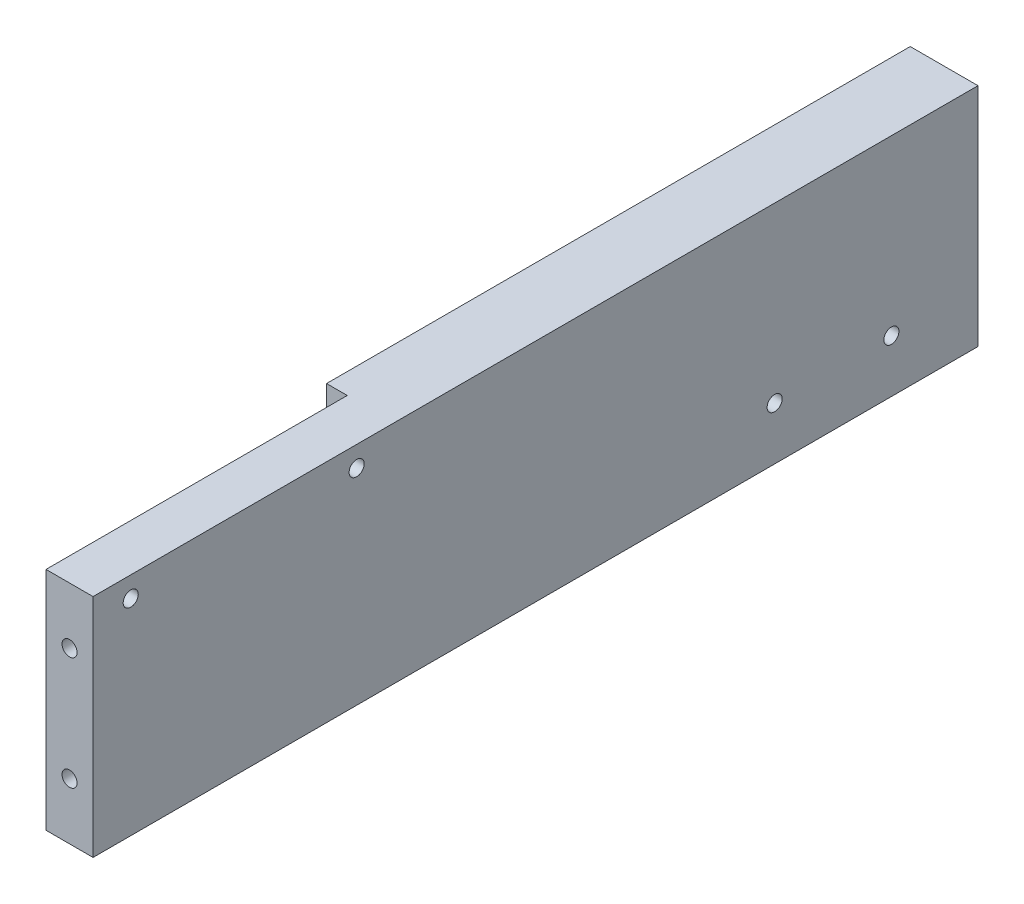
ISO-10303-21;
HEADER;
FILE_DESCRIPTION(('STEP AP214'),'2;1');
FILE_NAME('part.step','',(''),(''),'','','');
FILE_SCHEMA(('AUTOMOTIVE_DESIGN { 1 0 10303 214 1 1 1 1 }'));
ENDSEC;
DATA;
#1=APPLICATION_CONTEXT('core data for automotive mechanical design processes');
#2=APPLICATION_PROTOCOL_DEFINITION('international standard','automotive_design',2000,#1);
#3=PRODUCT_CONTEXT('',#1,'mechanical');
#4=PRODUCT('Part','Part','',(#3));
#5=PRODUCT_RELATED_PRODUCT_CATEGORY('part','',(#4));
#6=PRODUCT_DEFINITION_FORMATION('','',#4);
#7=PRODUCT_DEFINITION_CONTEXT('part definition',#1,'design');
#8=PRODUCT_DEFINITION('design','',#6,#7);
#9=PRODUCT_DEFINITION_SHAPE('','',#8);
#10=(LENGTH_UNIT() NAMED_UNIT(*) SI_UNIT(.MILLI.,.METRE.));
#11=(NAMED_UNIT(*) PLANE_ANGLE_UNIT() SI_UNIT($,.RADIAN.));
#12=(NAMED_UNIT(*) SI_UNIT($,.STERADIAN.) SOLID_ANGLE_UNIT());
#13=UNCERTAINTY_MEASURE_WITH_UNIT(LENGTH_MEASURE(1.E-05),#10,'distance_accuracy_value','');
#14=(GEOMETRIC_REPRESENTATION_CONTEXT(3) GLOBAL_UNCERTAINTY_ASSIGNED_CONTEXT((#13)) GLOBAL_UNIT_ASSIGNED_CONTEXT((#10,
#11,#12)) REPRESENTATION_CONTEXT('',''));
#15=CARTESIAN_POINT('',(0.,0.,0.));
#16=DIRECTION('',(0.,0.,1.));
#17=DIRECTION('',(1.,0.,0.));
#18=AXIS2_PLACEMENT_3D('',#15,#16,#17);
#19=CARTESIAN_POINT('',(-18.,8.00000000000001,0.));
#20=DIRECTION('',(0.,-1.,0.));
#21=DIRECTION('',(0.,0.,-1.));
#22=AXIS2_PLACEMENT_3D('',#19,#20,#21);
#23=PLANE('',#22);
#24=DIRECTION('',(0.,0.,-1.));
#25=VECTOR('',#24,1.);
#26=CARTESIAN_POINT('',(0.,8.00000000000001,0.));
#27=LINE('',#26,#25);
#28=CARTESIAN_POINT('',(0.,8.00000000000002,64.8267773742609));
#29=VERTEX_POINT('',#28);
#30=CARTESIAN_POINT('',(0.,7.99999999999998,-170.173222625739));
#31=VERTEX_POINT('',#30);
#32=EDGE_CURVE('E153',#29,#31,#27,.T.);
#33=ORIENTED_EDGE('',*,*,#32,.T.);
#34=DIRECTION('',(1.,0.,0.));
#35=VECTOR('',#34,1.);
#36=CARTESIAN_POINT('',(-18.,7.99999999999998,-170.173222625739));
#37=LINE('',#36,#35);
#38=CARTESIAN_POINT('',(-18.,7.99999999999998,-170.173222625739));
#39=VERTEX_POINT('',#38);
#40=EDGE_CURVE('E11',#39,#31,#37,.T.);
#41=ORIENTED_EDGE('',*,*,#40,.F.);
#42=DIRECTION('',(0.,0.,-1.));
#43=VECTOR('',#42,1.);
#44=CARTESIAN_POINT('',(-18.,8.00000000000001,0.));
#45=LINE('',#44,#43);
#46=CARTESIAN_POINT('',(-18.,8.00000000000001,-15.1732226257391));
#47=VERTEX_POINT('',#46);
#48=EDGE_CURVE('E140',#47,#39,#45,.T.);
#49=ORIENTED_EDGE('',*,*,#48,.F.);
#50=DIRECTION('',(1.,0.,0.));
#51=VECTOR('',#50,1.);
#52=CARTESIAN_POINT('',(-18.,8.00000000000001,-15.1732226257391));
#53=LINE('',#52,#51);
#54=CARTESIAN_POINT('',(-12.5,8.00000000000001,-15.1732226257391));
#55=VERTEX_POINT('',#54);
#56=EDGE_CURVE('E79',#47,#55,#53,.T.);
#57=ORIENTED_EDGE('',*,*,#56,.T.);
#58=DIRECTION('',(0.,0.,-1.));
#59=VECTOR('',#58,1.);
#60=CARTESIAN_POINT('',(-12.5,8.00000000000001,0.));
#61=LINE('',#60,#59);
#62=CARTESIAN_POINT('',(-12.5,8.00000000000002,64.8267773742609));
#63=VERTEX_POINT('',#62);
#64=EDGE_CURVE('E113',#63,#55,#61,.T.);
#65=ORIENTED_EDGE('',*,*,#64,.F.);
#66=DIRECTION('',(1.,0.,0.));
#67=VECTOR('',#66,1.);
#68=CARTESIAN_POINT('',(-12.5,8.00000000000002,64.8267773742609));
#69=LINE('',#68,#67);
#70=EDGE_CURVE('E98',#63,#29,#69,.T.);
#71=ORIENTED_EDGE('',*,*,#70,.T.);
#72=EDGE_LOOP('',(#33,#41,#49,#57,#65,#71));
#73=FACE_BOUND('',#72,.T.);
#74=ADVANCED_FACE('F35',(#73),#23,.F.);
#75=CARTESIAN_POINT('',(-18.,0.,-170.173222625739));
#76=DIRECTION('',(0.,0.,1.));
#77=DIRECTION('',(1.,0.,0.));
#78=AXIS2_PLACEMENT_3D('',#75,#76,#77);
#79=PLANE('',#78);
#80=DIRECTION('',(0.,-1.,0.));
#81=VECTOR('',#80,1.);
#82=CARTESIAN_POINT('',(0.,0.,-170.173222625739));
#83=LINE('',#82,#81);
#84=CARTESIAN_POINT('',(0.,-52.,-170.173222625739));
#85=VERTEX_POINT('',#84);
#86=EDGE_CURVE('E76',#31,#85,#83,.T.);
#87=ORIENTED_EDGE('',*,*,#86,.T.);
#88=DIRECTION('',(1.,0.,0.));
#89=VECTOR('',#88,1.);
#90=CARTESIAN_POINT('',(-18.,-52.,-170.173222625739));
#91=LINE('',#90,#89);
#92=CARTESIAN_POINT('',(-18.,-52.,-170.173222625739));
#93=VERTEX_POINT('',#92);
#94=EDGE_CURVE('E44',#93,#85,#91,.T.);
#95=ORIENTED_EDGE('',*,*,#94,.F.);
#96=DIRECTION('',(0.,-1.,0.));
#97=VECTOR('',#96,1.);
#98=CARTESIAN_POINT('',(-18.,0.,-170.173222625739));
#99=LINE('',#98,#97);
#100=EDGE_CURVE('E60',#39,#93,#99,.T.);
#101=ORIENTED_EDGE('',*,*,#100,.F.);
#102=ORIENTED_EDGE('',*,*,#40,.T.);
#103=EDGE_LOOP('',(#87,#95,#101,#102));
#104=FACE_BOUND('',#103,.T.);
#105=ADVANCED_FACE('F218',(#104),#79,.F.);
#106=CARTESIAN_POINT('',(-18.,-52.,0.));
#107=DIRECTION('',(0.,-1.,0.));
#108=DIRECTION('',(0.,0.,-1.));
#109=AXIS2_PLACEMENT_3D('',#106,#107,#108);
#110=PLANE('',#109);
#111=DIRECTION('',(0.,0.,-1.));
#112=VECTOR('',#111,1.);
#113=CARTESIAN_POINT('',(0.,-52.,0.));
#114=LINE('',#113,#112);
#115=CARTESIAN_POINT('',(0.,-52.,64.8267773742609));
#116=VERTEX_POINT('',#115);
#117=EDGE_CURVE('E155',#116,#85,#114,.T.);
#118=ORIENTED_EDGE('',*,*,#117,.F.);
#119=DIRECTION('',(1.,0.,0.));
#120=VECTOR('',#119,1.);
#121=CARTESIAN_POINT('',(-12.5,-52.,64.8267773742609));
#122=LINE('',#121,#120);
#123=CARTESIAN_POINT('',(-12.5,-52.,64.8267773742609));
#124=VERTEX_POINT('',#123);
#125=EDGE_CURVE('E109',#124,#116,#122,.T.);
#126=ORIENTED_EDGE('',*,*,#125,.F.);
#127=DIRECTION('',(0.,0.,-1.));
#128=VECTOR('',#127,1.);
#129=CARTESIAN_POINT('',(-12.5,-52.,0.));
#130=LINE('',#129,#128);
#131=CARTESIAN_POINT('',(-12.5,-52.,-15.1732226257391));
#132=VERTEX_POINT('',#131);
#133=EDGE_CURVE('E110',#124,#132,#130,.T.);
#134=ORIENTED_EDGE('',*,*,#133,.T.);
#135=DIRECTION('',(1.,0.,0.));
#136=VECTOR('',#135,1.);
#137=CARTESIAN_POINT('',(-18.,-52.,-15.1732226257391));
#138=LINE('',#137,#136);
#139=CARTESIAN_POINT('',(-18.,-52.,-15.1732226257391));
#140=VERTEX_POINT('',#139);
#141=EDGE_CURVE('E159',#140,#132,#138,.T.);
#142=ORIENTED_EDGE('',*,*,#141,.F.);
#143=DIRECTION('',(0.,0.,-1.));
#144=VECTOR('',#143,1.);
#145=CARTESIAN_POINT('',(-18.,-52.,0.));
#146=LINE('',#145,#144);
#147=EDGE_CURVE('E144',#140,#93,#146,.T.);
#148=ORIENTED_EDGE('',*,*,#147,.T.);
#149=ORIENTED_EDGE('',*,*,#94,.T.);
#150=EDGE_LOOP('',(#118,#126,#134,#142,#148,#149));
#151=FACE_BOUND('',#150,.T.);
#152=ADVANCED_FACE('F223',(#151),#110,.T.);
#153=CARTESIAN_POINT('',(-18.,-38.,-147.173222625739));
#154=DIRECTION('',(1.,0.,0.));
#155=DIRECTION('',(0.,0.,-1.));
#156=AXIS2_PLACEMENT_3D('',#153,#154,#155);
#157=CYLINDRICAL_SURFACE('',#156,2.);
#158=CARTESIAN_POINT('',(-18.,-38.,-147.173222625739));
#159=DIRECTION('',(1.,0.,0.));
#160=DIRECTION('',(0.,0.,-1.));
#161=AXIS2_PLACEMENT_3D('',#158,#159,#160);
#162=CIRCLE('',#161,2.);
#163=CARTESIAN_POINT('',(-18.,-38.,-149.173222625739));
#164=VERTEX_POINT('',#163);
#165=EDGE_CURVE('E137',#164,#164,#162,.T.);
#166=ORIENTED_EDGE('',*,*,#165,.F.);
#167=EDGE_LOOP('',(#166));
#168=FACE_BOUND('',#167,.T.);
#169=CARTESIAN_POINT('',(0.,-38.,-147.173222625739));
#170=DIRECTION('',(1.,0.,0.));
#171=DIRECTION('',(0.,0.,-1.));
#172=AXIS2_PLACEMENT_3D('',#169,#170,#171);
#173=CIRCLE('',#172,2.);
#174=CARTESIAN_POINT('',(0.,-38.,-149.173222625739));
#175=VERTEX_POINT('',#174);
#176=EDGE_CURVE('E150',#175,#175,#173,.T.);
#177=ORIENTED_EDGE('',*,*,#176,.T.);
#178=EDGE_LOOP('',(#177));
#179=FACE_BOUND('',#178,.T.);
#180=ADVANCED_FACE('F228',(#168,#179),#157,.F.);
#181=CARTESIAN_POINT('',(-18.,-38.,-116.173222625739));
#182=DIRECTION('',(1.,0.,0.));
#183=DIRECTION('',(0.,0.,-1.));
#184=AXIS2_PLACEMENT_3D('',#181,#182,#183);
#185=CYLINDRICAL_SURFACE('',#184,2.);
#186=CARTESIAN_POINT('',(-18.,-38.,-116.173222625739));
#187=DIRECTION('',(1.,0.,0.));
#188=DIRECTION('',(0.,0.,-1.));
#189=AXIS2_PLACEMENT_3D('',#186,#187,#188);
#190=CIRCLE('',#189,2.);
#191=CARTESIAN_POINT('',(-18.,-38.,-118.173222625739));
#192=VERTEX_POINT('',#191);
#193=EDGE_CURVE('E134',#192,#192,#190,.T.);
#194=ORIENTED_EDGE('',*,*,#193,.F.);
#195=EDGE_LOOP('',(#194));
#196=FACE_BOUND('',#195,.T.);
#197=CARTESIAN_POINT('',(0.,-38.,-116.173222625739));
#198=DIRECTION('',(1.,0.,0.));
#199=DIRECTION('',(0.,0.,-1.));
#200=AXIS2_PLACEMENT_3D('',#197,#198,#199);
#201=CIRCLE('',#200,2.);
#202=CARTESIAN_POINT('',(0.,-38.,-118.173222625739));
#203=VERTEX_POINT('',#202);
#204=EDGE_CURVE('E132',#203,#203,#201,.T.);
#205=ORIENTED_EDGE('',*,*,#204,.T.);
#206=EDGE_LOOP('',(#205));
#207=FACE_BOUND('',#206,.T.);
#208=ADVANCED_FACE('F37',(#196,#207),#185,.F.);
#209=CARTESIAN_POINT('',(-18.,0.,-15.1732226257391));
#210=DIRECTION('',(0.,0.,1.));
#211=DIRECTION('',(0.,-1.,0.));
#212=AXIS2_PLACEMENT_3D('',#209,#210,#211);
#213=PLANE('',#212);
#214=DIRECTION('',(0.,-1.,0.));
#215=VECTOR('',#214,1.);
#216=CARTESIAN_POINT('',(-12.5,0.,-15.1732226257391));
#217=LINE('',#216,#215);
#218=EDGE_CURVE('E52',#55,#132,#217,.T.);
#219=ORIENTED_EDGE('',*,*,#218,.F.);
#220=ORIENTED_EDGE('',*,*,#56,.F.);
#221=DIRECTION('',(0.,-1.,0.));
#222=VECTOR('',#221,1.);
#223=CARTESIAN_POINT('',(-18.,0.,-15.1732226257391));
#224=LINE('',#223,#222);
#225=EDGE_CURVE('E142',#47,#140,#224,.T.);
#226=ORIENTED_EDGE('',*,*,#225,.T.);
#227=ORIENTED_EDGE('',*,*,#141,.T.);
#228=EDGE_LOOP('',(#219,#220,#226,#227));
#229=FACE_BOUND('',#228,.T.);
#230=ADVANCED_FACE('F226',(#229),#213,.T.);
#231=CARTESIAN_POINT('',(-18.,0.,0.));
#232=DIRECTION('',(1.,0.,0.));
#233=DIRECTION('',(0.,0.,-1.));
#234=AXIS2_PLACEMENT_3D('',#231,#232,#233);
#235=PLANE('',#234);
#236=ORIENTED_EDGE('',*,*,#193,.T.);
#237=EDGE_LOOP('',(#236));
#238=FACE_BOUND('',#237,.T.);
#239=ORIENTED_EDGE('',*,*,#165,.T.);
#240=EDGE_LOOP('',(#239));
#241=FACE_BOUND('',#240,.T.);
#242=ORIENTED_EDGE('',*,*,#48,.T.);
#243=ORIENTED_EDGE('',*,*,#100,.T.);
#244=ORIENTED_EDGE('',*,*,#147,.F.);
#245=ORIENTED_EDGE('',*,*,#225,.F.);
#246=EDGE_LOOP('',(#242,#243,#244,#245));
#247=FACE_BOUND('',#246,.T.);
#248=ADVANCED_FACE('F242',(#238,#241,#247),#235,.F.);
#249=CARTESIAN_POINT('',(0.,0.,0.));
#250=DIRECTION('',(1.,0.,0.));
#251=DIRECTION('',(0.,0.,-1.));
#252=AXIS2_PLACEMENT_3D('',#249,#250,#251);
#253=PLANE('',#252);
#254=ORIENTED_EDGE('',*,*,#204,.F.);
#255=EDGE_LOOP('',(#254));
#256=FACE_BOUND('',#255,.T.);
#257=ORIENTED_EDGE('',*,*,#176,.F.);
#258=EDGE_LOOP('',(#257));
#259=FACE_BOUND('',#258,.T.);
#260=ORIENTED_EDGE('',*,*,#32,.F.);
#261=DIRECTION('',(0.,-1.,0.));
#262=VECTOR('',#261,1.);
#263=CARTESIAN_POINT('',(0.,0.,64.8267773742609));
#264=LINE('',#263,#262);
#265=EDGE_CURVE('E106',#29,#116,#264,.T.);
#266=ORIENTED_EDGE('',*,*,#265,.T.);
#267=ORIENTED_EDGE('',*,*,#117,.T.);
#268=ORIENTED_EDGE('',*,*,#86,.F.);
#269=EDGE_LOOP('',(#260,#266,#267,#268));
#270=FACE_BOUND('',#269,.T.);
#271=CARTESIAN_POINT('',(0.,2.55000000000001,-5.17322262573905));
#272=DIRECTION('',(1.,0.,0.));
#273=DIRECTION('',(0.,0.,-1.));
#274=AXIS2_PLACEMENT_3D('',#271,#272,#273);
#275=CIRCLE('',#274,2.);
#276=CARTESIAN_POINT('',(0.,2.55000000000001,-7.17322262573905));
#277=VERTEX_POINT('',#276);
#278=EDGE_CURVE('E123',#277,#277,#275,.T.);
#279=ORIENTED_EDGE('',*,*,#278,.F.);
#280=EDGE_LOOP('',(#279));
#281=FACE_BOUND('',#280,.T.);
#282=CARTESIAN_POINT('',(0.,2.55000000000002,54.8267773742609));
#283=DIRECTION('',(1.,0.,0.));
#284=DIRECTION('',(0.,0.,-1.));
#285=AXIS2_PLACEMENT_3D('',#282,#283,#284);
#286=CIRCLE('',#285,2.);
#287=CARTESIAN_POINT('',(0.,2.55000000000002,52.8267773742609));
#288=VERTEX_POINT('',#287);
#289=EDGE_CURVE('E126',#288,#288,#286,.T.);
#290=ORIENTED_EDGE('',*,*,#289,.F.);
#291=EDGE_LOOP('',(#290));
#292=FACE_BOUND('',#291,.T.);
#293=ADVANCED_FACE('F199',(#256,#259,#270,#281,#292),#253,.T.);
#294=CARTESIAN_POINT('',(-12.5,0.,64.8267773742609));
#295=DIRECTION('',(0.,0.,1.));
#296=DIRECTION('',(0.,-1.,0.));
#297=AXIS2_PLACEMENT_3D('',#294,#295,#296);
#298=PLANE('',#297);
#299=CARTESIAN_POINT('',(-6.24999999999999,-37.,64.8267773742609));
#300=DIRECTION('',(0.,0.,1.));
#301=DIRECTION('',(1.,0.,0.));
#302=AXIS2_PLACEMENT_3D('',#299,#300,#301);
#303=CIRCLE('',#302,2.);
#304=CARTESIAN_POINT('',(-4.24999999999999,-37.,64.8267773742609));
#305=VERTEX_POINT('',#304);
#306=EDGE_CURVE('E181',#305,#305,#303,.T.);
#307=ORIENTED_EDGE('',*,*,#306,.F.);
#308=EDGE_LOOP('',(#307));
#309=FACE_BOUND('',#308,.T.);
#310=CARTESIAN_POINT('',(-6.25,-6.99999999999998,64.8267773742609));
#311=DIRECTION('',(0.,0.,1.));
#312=DIRECTION('',(1.,0.,0.));
#313=AXIS2_PLACEMENT_3D('',#310,#311,#312);
#314=CIRCLE('',#313,2.);
#315=CARTESIAN_POINT('',(-4.25,-6.99999999999998,64.8267773742609));
#316=VERTEX_POINT('',#315);
#317=EDGE_CURVE('E175',#316,#316,#314,.T.);
#318=ORIENTED_EDGE('',*,*,#317,.F.);
#319=EDGE_LOOP('',(#318));
#320=FACE_BOUND('',#319,.T.);
#321=ORIENTED_EDGE('',*,*,#265,.F.);
#322=ORIENTED_EDGE('',*,*,#70,.F.);
#323=DIRECTION('',(0.,-1.,0.));
#324=VECTOR('',#323,1.);
#325=CARTESIAN_POINT('',(-12.5,0.,64.8267773742609));
#326=LINE('',#325,#324);
#327=EDGE_CURVE('E103',#63,#124,#326,.T.);
#328=ORIENTED_EDGE('',*,*,#327,.T.);
#329=ORIENTED_EDGE('',*,*,#125,.T.);
#330=EDGE_LOOP('',(#321,#322,#328,#329));
#331=FACE_BOUND('',#330,.T.);
#332=ADVANCED_FACE('F100',(#309,#320,#331),#298,.T.);
#333=CARTESIAN_POINT('',(-12.5,2.55000000000002,54.8267773742609));
#334=DIRECTION('',(1.,0.,0.));
#335=DIRECTION('',(0.,0.,-1.));
#336=AXIS2_PLACEMENT_3D('',#333,#334,#335);
#337=CYLINDRICAL_SURFACE('',#336,2.);
#338=CARTESIAN_POINT('',(-12.5,2.55000000000002,54.8267773742609));
#339=DIRECTION('',(1.,0.,0.));
#340=DIRECTION('',(0.,0.,-1.));
#341=AXIS2_PLACEMENT_3D('',#338,#339,#340);
#342=CIRCLE('',#341,2.);
#343=CARTESIAN_POINT('',(-12.5,2.55000000000002,52.8267773742609));
#344=VERTEX_POINT('',#343);
#345=EDGE_CURVE('E166',#344,#344,#342,.T.);
#346=ORIENTED_EDGE('',*,*,#345,.F.);
#347=EDGE_LOOP('',(#346));
#348=FACE_BOUND('',#347,.T.);
#349=ORIENTED_EDGE('',*,*,#289,.T.);
#350=EDGE_LOOP('',(#349));
#351=FACE_BOUND('',#350,.T.);
#352=ADVANCED_FACE('F198',(#348,#351),#337,.F.);
#353=CARTESIAN_POINT('',(-12.5,2.55000000000001,-5.17322262573905));
#354=DIRECTION('',(1.,0.,0.));
#355=DIRECTION('',(0.,0.,-1.));
#356=AXIS2_PLACEMENT_3D('',#353,#354,#355);
#357=CYLINDRICAL_SURFACE('',#356,2.);
#358=CARTESIAN_POINT('',(-12.5,2.55000000000001,-5.17322262573905));
#359=DIRECTION('',(1.,0.,0.));
#360=DIRECTION('',(0.,0.,-1.));
#361=AXIS2_PLACEMENT_3D('',#358,#359,#360);
#362=CIRCLE('',#361,2.);
#363=CARTESIAN_POINT('',(-12.5,2.55000000000001,-7.17322262573905));
#364=VERTEX_POINT('',#363);
#365=EDGE_CURVE('E131',#364,#364,#362,.T.);
#366=ORIENTED_EDGE('',*,*,#365,.F.);
#367=EDGE_LOOP('',(#366));
#368=FACE_BOUND('',#367,.T.);
#369=ORIENTED_EDGE('',*,*,#278,.T.);
#370=EDGE_LOOP('',(#369));
#371=FACE_BOUND('',#370,.T.);
#372=ADVANCED_FACE('F213',(#368,#371),#357,.F.);
#373=CARTESIAN_POINT('',(-12.5,0.,0.));
#374=DIRECTION('',(1.,0.,0.));
#375=DIRECTION('',(0.,0.,-1.));
#376=AXIS2_PLACEMENT_3D('',#373,#374,#375);
#377=PLANE('',#376);
#378=ORIENTED_EDGE('',*,*,#365,.T.);
#379=EDGE_LOOP('',(#378));
#380=FACE_BOUND('',#379,.T.);
#381=ORIENTED_EDGE('',*,*,#345,.T.);
#382=EDGE_LOOP('',(#381));
#383=FACE_BOUND('',#382,.T.);
#384=ORIENTED_EDGE('',*,*,#218,.T.);
#385=ORIENTED_EDGE('',*,*,#133,.F.);
#386=ORIENTED_EDGE('',*,*,#327,.F.);
#387=ORIENTED_EDGE('',*,*,#64,.T.);
#388=EDGE_LOOP('',(#384,#385,#386,#387));
#389=FACE_BOUND('',#388,.T.);
#390=ADVANCED_FACE('F115',(#380,#383,#389),#377,.F.);
#391=CARTESIAN_POINT('',(-6.25,-6.99999999999998,54.8267773742609));
#392=DIRECTION('',(0.,0.,1.));
#393=DIRECTION('',(1.,0.,0.));
#394=AXIS2_PLACEMENT_3D('',#391,#392,#393);
#395=CYLINDRICAL_SURFACE('',#394,2.);
#396=CARTESIAN_POINT('',(-6.25,-6.99999999999998,54.8267773742609));
#397=DIRECTION('',(0.,0.,1.));
#398=DIRECTION('',(1.,0.,0.));
#399=AXIS2_PLACEMENT_3D('',#396,#397,#398);
#400=CIRCLE('',#399,2.);
#401=CARTESIAN_POINT('',(-4.25,-6.99999999999998,54.8267773742609));
#402=VERTEX_POINT('',#401);
#403=EDGE_CURVE('E127',#402,#402,#400,.T.);
#404=ORIENTED_EDGE('',*,*,#403,.F.);
#405=EDGE_LOOP('',(#404));
#406=FACE_BOUND('',#405,.T.);
#407=ORIENTED_EDGE('',*,*,#317,.T.);
#408=EDGE_LOOP('',(#407));
#409=FACE_BOUND('',#408,.T.);
#410=ADVANCED_FACE('F203',(#406,#409),#395,.F.);
#411=CARTESIAN_POINT('',(-6.25,-6.99999999999998,54.8267773742609));
#412=DIRECTION('',(0.,0.,1.));
#413=DIRECTION('',(1.,0.,0.));
#414=AXIS2_PLACEMENT_3D('',#411,#412,#413);
#415=PLANE('',#414);
#416=ORIENTED_EDGE('',*,*,#403,.T.);
#417=EDGE_LOOP('',(#416));
#418=FACE_BOUND('',#417,.T.);
#419=ADVANCED_FACE('F192',(#418),#415,.T.);
#420=CARTESIAN_POINT('',(-6.24999999999999,-37.,54.8267773742609));
#421=DIRECTION('',(0.,0.,1.));
#422=DIRECTION('',(1.,0.,0.));
#423=AXIS2_PLACEMENT_3D('',#420,#421,#422);
#424=CYLINDRICAL_SURFACE('',#423,2.);
#425=CARTESIAN_POINT('',(-6.24999999999999,-37.,54.8267773742609));
#426=DIRECTION('',(0.,0.,1.));
#427=DIRECTION('',(1.,0.,0.));
#428=AXIS2_PLACEMENT_3D('',#425,#426,#427);
#429=CIRCLE('',#428,2.);
#430=CARTESIAN_POINT('',(-4.24999999999999,-37.,54.8267773742609));
#431=VERTEX_POINT('',#430);
#432=EDGE_CURVE('E178',#431,#431,#429,.T.);
#433=ORIENTED_EDGE('',*,*,#432,.F.);
#434=EDGE_LOOP('',(#433));
#435=FACE_BOUND('',#434,.T.);
#436=ORIENTED_EDGE('',*,*,#306,.T.);
#437=EDGE_LOOP('',(#436));
#438=FACE_BOUND('',#437,.T.);
#439=ADVANCED_FACE('F189',(#435,#438),#424,.F.);
#440=CARTESIAN_POINT('',(-6.24999999999999,-37.,54.8267773742609));
#441=DIRECTION('',(0.,0.,1.));
#442=DIRECTION('',(1.,0.,0.));
#443=AXIS2_PLACEMENT_3D('',#440,#441,#442);
#444=PLANE('',#443);
#445=ORIENTED_EDGE('',*,*,#432,.T.);
#446=EDGE_LOOP('',(#445));
#447=FACE_BOUND('',#446,.T.);
#448=ADVANCED_FACE('F187',(#447),#444,.T.);
#449=CLOSED_SHELL('',(#74,#105,#152,#180,#208,#230,#248,#293,#332,#352,#372,#390,#410,#419,#439,#448));
#450=MANIFOLD_SOLID_BREP('B2',#449);
#451=ADVANCED_BREP_SHAPE_REPRESENTATION('',(#18,#450),#14);
#452=SHAPE_DEFINITION_REPRESENTATION(#9,#451);
ENDSEC;
END-ISO-10303-21;
